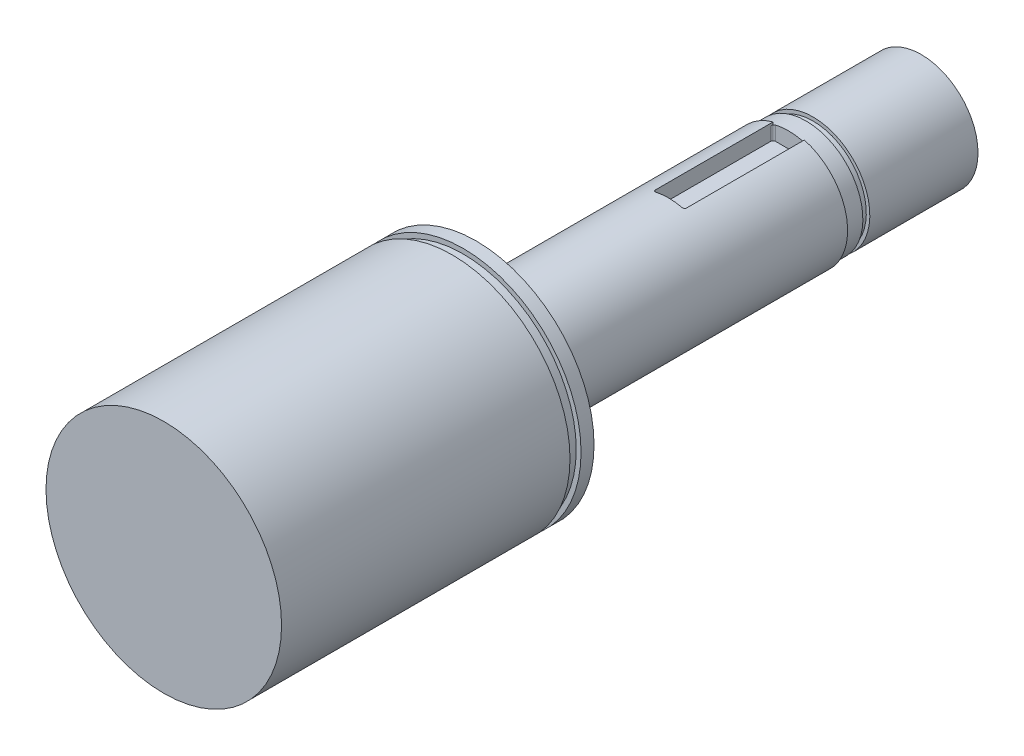
ISO-10303-21;
HEADER;
FILE_DESCRIPTION(('STEP AP214'),'2;1');
FILE_NAME('part.step','',(''),(''),'','','');
FILE_SCHEMA(('AUTOMOTIVE_DESIGN { 1 0 10303 214 1 1 1 1 }'));
ENDSEC;
DATA;
#1=APPLICATION_CONTEXT('core data for automotive mechanical design processes');
#2=APPLICATION_PROTOCOL_DEFINITION('international standard','automotive_design',2000,#1);
#3=PRODUCT_CONTEXT('',#1,'mechanical');
#4=PRODUCT('Part','Part','',(#3));
#5=PRODUCT_RELATED_PRODUCT_CATEGORY('part','',(#4));
#6=PRODUCT_DEFINITION_FORMATION('','',#4);
#7=PRODUCT_DEFINITION_CONTEXT('part definition',#1,'design');
#8=PRODUCT_DEFINITION('design','',#6,#7);
#9=PRODUCT_DEFINITION_SHAPE('','',#8);
#10=(LENGTH_UNIT() NAMED_UNIT(*) SI_UNIT(.MILLI.,.METRE.));
#11=(NAMED_UNIT(*) PLANE_ANGLE_UNIT() SI_UNIT($,.RADIAN.));
#12=(NAMED_UNIT(*) SI_UNIT($,.STERADIAN.) SOLID_ANGLE_UNIT());
#13=UNCERTAINTY_MEASURE_WITH_UNIT(LENGTH_MEASURE(1.E-05),#10,'distance_accuracy_value','');
#14=(GEOMETRIC_REPRESENTATION_CONTEXT(3) GLOBAL_UNCERTAINTY_ASSIGNED_CONTEXT((#13)) GLOBAL_UNIT_ASSIGNED_CONTEXT((#10,
#11,#12)) REPRESENTATION_CONTEXT('',''));
#15=CARTESIAN_POINT('',(0.,0.,0.));
#16=DIRECTION('',(0.,0.,1.));
#17=DIRECTION('',(1.,0.,0.));
#18=AXIS2_PLACEMENT_3D('',#15,#16,#17);
#19=CARTESIAN_POINT('',(0.,0.,33.02));
#20=DIRECTION('',(0.,0.,-1.));
#21=DIRECTION('',(-1.,0.,0.));
#22=AXIS2_PLACEMENT_3D('',#19,#20,#21);
#23=CYLINDRICAL_SURFACE('',#22,6.223);
#24=CARTESIAN_POINT('',(0.,0.,0.));
#25=DIRECTION('',(0.,0.,1.));
#26=DIRECTION('',(1.,0.,0.));
#27=AXIS2_PLACEMENT_3D('',#24,#25,#26);
#28=CIRCLE('',#27,6.223);
#29=CARTESIAN_POINT('',(-1.651,5.999993999997,0.));
#30=VERTEX_POINT('',#29);
#31=CARTESIAN_POINT('',(1.651,5.999993999997,0.));
#32=VERTEX_POINT('',#31);
#33=EDGE_CURVE('E144',#30,#32,#28,.T.);
#34=ORIENTED_EDGE('',*,*,#33,.T.);
#35=DIRECTION('',(0.,0.,-1.));
#36=VECTOR('',#35,1.);
#37=CARTESIAN_POINT('',(1.651,5.999993999997,33.02));
#38=LINE('',#37,#36);
#39=CARTESIAN_POINT('',(1.651,5.999993999997,12.446));
#40=VERTEX_POINT('',#39);
#41=EDGE_CURVE('E169',#32,#40,#38,.F.);
#42=ORIENTED_EDGE('',*,*,#41,.T.);
#43=CARTESIAN_POINT('',(1.651,5.999993999997,12.446));
#44=CARTESIAN_POINT('',(1.6510136591132,5.99998885600186,12.4599371532582));
#45=CARTESIAN_POINT('',(1.6498537940889,6.00030938344019,12.473867225153));
#46=CARTESIAN_POINT('',(1.64529192026899,6.00156258454862,12.5013011630621));
#47=CARTESIAN_POINT('',(1.64189411683366,6.00249411006494,12.514805778784));
#48=CARTESIAN_POINT('',(1.63296019772344,6.00493047717273,12.5410329475935));
#49=CARTESIAN_POINT('',(1.62742390823833,6.00643536536539,12.5537554370146));
#50=CARTESIAN_POINT('',(1.61439639075044,6.00994999603842,12.5780798810677));
#51=CARTESIAN_POINT('',(1.60690488308525,6.01195981073884,12.5896816750768));
#52=CARTESIAN_POINT('',(1.59005297817903,6.01643893737926,12.6116547380317));
#53=CARTESIAN_POINT('',(1.58066333766302,6.01891539200831,12.6220020993992));
#54=CARTESIAN_POINT('',(1.56037002430933,6.02420818200575,12.6409855630794));
#55=CARTESIAN_POINT('',(1.54946594231671,6.02702460919715,12.6496212014024));
#56=CARTESIAN_POINT('',(1.52606255784957,6.03299365715654,12.6652332823865));
#57=CARTESIAN_POINT('',(1.51352242704203,6.03615431562268,12.6721454129126));
#58=CARTESIAN_POINT('',(1.48749417753384,6.04262109166117,12.6837598850571));
#59=CARTESIAN_POINT('',(1.47400630082956,6.0459271720216,12.6884627884369));
#60=CARTESIAN_POINT('',(1.44990836609662,6.05174416176689,12.6946571828533));
#61=CARTESIAN_POINT('',(1.43942410890025,6.05424673157387,12.6966580963021));
#62=CARTESIAN_POINT('',(1.41829673705527,6.05923119850961,12.6993296549334));
#63=CARTESIAN_POINT('',(1.40765383682191,6.061713117527,12.7000019559701));
#64=CARTESIAN_POINT('',(1.397,6.06416688424717,12.7));
#65=B_SPLINE_CURVE_WITH_KNOTS('',3,(#43,#44,#45,#46,#47,#48,#49,#50,#51,#52,#53,#54,#55,#56,#57,
#58,#59,#60,#61,#62,#63,#64),.UNSPECIFIED.,.F.,.F.,(4,2,2,2,2,2,2,2,2,2,4),(0.,
0.0417488156054149,0.0834194030451652,0.125093378067803,0.166773317150151,0.209152456981567,
0.251543068690232,0.295335507240234,0.339116804228455,0.371927199746421,0.40469667770493),.UNSPECIFIED.);
#66=CARTESIAN_POINT('',(1.397,6.06416688424717,12.7));
#67=VERTEX_POINT('',#66);
#68=EDGE_CURVE('E49',#40,#67,#65,.T.);
#69=ORIENTED_EDGE('',*,*,#68,.T.);
#70=CARTESIAN_POINT('',(0.,0.,12.7));
#71=DIRECTION('',(0.,0.,-1.));
#72=DIRECTION('',(-1.,0.,0.));
#73=AXIS2_PLACEMENT_3D('',#70,#71,#72);
#74=CIRCLE('',#73,6.223);
#75=CARTESIAN_POINT('',(-1.397,6.06416688424717,12.7));
#76=VERTEX_POINT('',#75);
#77=EDGE_CURVE('E139',#76,#67,#74,.T.);
#78=ORIENTED_EDGE('',*,*,#77,.F.);
#79=CARTESIAN_POINT('',(-1.397,6.06416688424717,12.7));
#80=CARTESIAN_POINT('',(-1.41165090529352,6.06079390642007,12.700010270971));
#81=CARTESIAN_POINT('',(-1.42628522450905,6.05736460837732,12.6987330395745));
#82=CARTESIAN_POINT('',(-1.45511557715207,6.05050247974281,12.69369188033));
#83=CARTESIAN_POINT('',(-1.46931169749557,6.04706964999295,12.6899284489764));
#84=CARTESIAN_POINT('',(-1.49687397781058,6.04030634903221,12.6800005140272));
#85=CARTESIAN_POINT('',(-1.51023969599947,6.03697593277421,12.6738347448327));
#86=CARTESIAN_POINT('',(-1.53574481264174,6.03053807691927,12.659263665385));
#87=CARTESIAN_POINT('',(-1.54788455576024,6.02743057472483,12.6508589869994));
#88=CARTESIAN_POINT('',(-1.57048207326345,6.02158206406083,12.6321017576408));
#89=CARTESIAN_POINT('',(-1.58095273326457,6.01883827849694,12.6217656175073));
#90=CARTESIAN_POINT('',(-1.59999919464336,6.0138031951122,12.5993729634366));
#91=CARTESIAN_POINT('',(-1.60857481888172,6.01151193959392,12.587316288845));
#92=CARTESIAN_POINT('',(-1.62332418480106,6.0075456300982,12.5621883274646));
#93=CARTESIAN_POINT('',(-1.62955873906087,6.00585504693317,12.549155151668));
#94=CARTESIAN_POINT('',(-1.63973781672755,6.00308395845329,12.5221690940492));
#95=CARTESIAN_POINT('',(-1.64368485486539,6.00200278323511,12.5082172410241));
#96=CARTESIAN_POINT('',(-1.64794141373288,6.00083497827377,12.4861186857271));
#97=CARTESIAN_POINT('',(-1.64908770036318,6.00051995801422,12.4781359369184));
#98=CARTESIAN_POINT('',(-1.65061671687385,6.0000994744892,12.4621034918921));
#99=CARTESIAN_POINT('',(-1.65100051257263,5.99999371871231,12.4540539049398));
#100=CARTESIAN_POINT('',(-1.65100000000012,5.99999399999709,12.446));
#101=B_SPLINE_CURVE_WITH_KNOTS('',3,(#79,#80,#81,#82,#83,#84,#85,#86,#87,#88,#89,#90,#91,#92,
#93,#94,#95,#96,#97,#98,#99,#100),.UNSPECIFIED.,.F.,.F.,(4,2,2,2,2,2,2,2,2,2,4),(0.,
0.0450436059598747,0.0900782194225985,0.135136590154683,0.180182257906668,0.224861291388814,
0.269544499498677,0.312969989332677,0.356347649301799,0.380524910361107,0.404668352327528),.UNSPECIFIED.);
#102=CARTESIAN_POINT('',(-1.651,5.999993999997,12.446));
#103=VERTEX_POINT('',#102);
#104=EDGE_CURVE('E11',#76,#103,#101,.T.);
#105=ORIENTED_EDGE('',*,*,#104,.T.);
#106=DIRECTION('',(0.,0.,-1.));
#107=VECTOR('',#106,1.);
#108=CARTESIAN_POINT('',(-1.651,5.999993999997,33.02));
#109=LINE('',#108,#107);
#110=EDGE_CURVE('E167',#103,#30,#109,.T.);
#111=ORIENTED_EDGE('',*,*,#110,.T.);
#112=EDGE_LOOP('',(#34,#42,#69,#78,#105,#111));
#113=FACE_BOUND('',#112,.T.);
#114=CARTESIAN_POINT('',(0.,0.,33.02));
#115=DIRECTION('',(0.,0.,1.));
#116=DIRECTION('',(1.,0.,0.));
#117=AXIS2_PLACEMENT_3D('',#114,#115,#116);
#118=CIRCLE('',#117,6.223);
#119=CARTESIAN_POINT('',(6.223,0.,33.02));
#120=VERTEX_POINT('',#119);
#121=EDGE_CURVE('E178',#120,#120,#118,.T.);
#122=ORIENTED_EDGE('',*,*,#121,.F.);
#123=EDGE_LOOP('',(#122));
#124=FACE_BOUND('',#123,.T.);
#125=ADVANCED_FACE('F35',(#113,#124),#23,.T.);
#126=CARTESIAN_POINT('',(0.,0.,0.));
#127=DIRECTION('',(0.,0.,1.));
#128=DIRECTION('',(1.,0.,0.));
#129=AXIS2_PLACEMENT_3D('',#126,#127,#128);
#130=PLANE('',#129);
#131=DIRECTION('',(0.,1.,0.));
#132=VECTOR('',#131,1.);
#133=CARTESIAN_POINT('',(-1.651,7.650993999997,0.));
#134=LINE('',#133,#132);
#135=CARTESIAN_POINT('',(-1.651,5.76837923510582,0.));
#136=VERTEX_POINT('',#135);
#137=EDGE_CURVE('E125',#136,#30,#134,.T.);
#138=ORIENTED_EDGE('',*,*,#137,.F.);
#139=CARTESIAN_POINT('',(0.,0.,0.));
#140=DIRECTION('',(0.,0.,1.));
#141=DIRECTION('',(0.124481116014532,-0.992221977057441,0.));
#142=AXIS2_PLACEMENT_3D('',#139,#140,#141);
#143=CIRCLE('',#142,6.);
#144=CARTESIAN_POINT('',(1.651,5.76837923510582,0.));
#145=VERTEX_POINT('',#144);
#146=EDGE_CURVE('E132',#136,#145,#143,.T.);
#147=ORIENTED_EDGE('',*,*,#146,.T.);
#148=DIRECTION('',(0.,-1.,0.));
#149=VECTOR('',#148,1.);
#150=CARTESIAN_POINT('',(1.651,7.650993999997,0.));
#151=LINE('',#150,#149);
#152=EDGE_CURVE('E152',#32,#145,#151,.T.);
#153=ORIENTED_EDGE('',*,*,#152,.F.);
#154=ORIENTED_EDGE('',*,*,#33,.F.);
#155=EDGE_LOOP('',(#138,#147,#153,#154));
#156=FACE_BOUND('',#155,.T.);
#157=ADVANCED_FACE('F142',(#156),#130,.F.);
#158=CARTESIAN_POINT('',(0.,0.,66.04));
#159=DIRECTION('',(0.,0.,-1.));
#160=DIRECTION('',(-1.,0.,0.));
#161=AXIS2_PLACEMENT_3D('',#158,#159,#160);
#162=CYLINDRICAL_SURFACE('',#161,12.446);
#163=CARTESIAN_POINT('',(0.,0.,34.3916));
#164=DIRECTION('',(0.,0.,-1.));
#165=DIRECTION('',(-1.,0.,0.));
#166=AXIS2_PLACEMENT_3D('',#163,#164,#165);
#167=CIRCLE('',#166,12.446);
#168=CARTESIAN_POINT('',(-12.446,0.,34.3916));
#169=VERTEX_POINT('',#168);
#170=EDGE_CURVE('E170',#169,#169,#167,.T.);
#171=ORIENTED_EDGE('',*,*,#170,.T.);
#172=EDGE_LOOP('',(#171));
#173=FACE_BOUND('',#172,.T.);
#174=CARTESIAN_POINT('',(0.,0.,33.02));
#175=DIRECTION('',(0.,0.,1.));
#176=DIRECTION('',(1.,0.,0.));
#177=AXIS2_PLACEMENT_3D('',#174,#175,#176);
#178=CIRCLE('',#177,12.446);
#179=CARTESIAN_POINT('',(12.446,0.,33.02));
#180=VERTEX_POINT('',#179);
#181=EDGE_CURVE('E172',#180,#180,#178,.T.);
#182=ORIENTED_EDGE('',*,*,#181,.T.);
#183=EDGE_LOOP('',(#182));
#184=FACE_BOUND('',#183,.T.);
#185=ADVANCED_FACE('F310',(#173,#184),#162,.T.);
#186=CARTESIAN_POINT('',(0.,0.,33.02));
#187=DIRECTION('',(0.,0.,1.));
#188=DIRECTION('',(1.,0.,0.));
#189=AXIS2_PLACEMENT_3D('',#186,#187,#188);
#190=PLANE('',#189);
#191=ORIENTED_EDGE('',*,*,#121,.T.);
#192=EDGE_LOOP('',(#191));
#193=FACE_BOUND('',#192,.T.);
#194=ORIENTED_EDGE('',*,*,#181,.F.);
#195=EDGE_LOOP('',(#194));
#196=FACE_BOUND('',#195,.T.);
#197=ADVANCED_FACE('F314',(#193,#196),#190,.F.);
#198=CARTESIAN_POINT('',(0.,0.,34.3916));
#199=DIRECTION('',(0.,0.,-1.));
#200=DIRECTION('',(-1.,0.,0.));
#201=AXIS2_PLACEMENT_3D('',#198,#199,#200);
#202=PLANE('',#201);
#203=CARTESIAN_POINT('',(0.,0.,34.3916));
#204=DIRECTION('',(0.,0.,1.));
#205=DIRECTION('',(1.,0.,0.));
#206=AXIS2_PLACEMENT_3D('',#203,#204,#205);
#207=CIRCLE('',#206,11.938);
#208=CARTESIAN_POINT('',(11.938,0.,34.3916));
#209=VERTEX_POINT('',#208);
#210=EDGE_CURVE('E161',#209,#209,#207,.T.);
#211=ORIENTED_EDGE('',*,*,#210,.F.);
#212=EDGE_LOOP('',(#211));
#213=FACE_BOUND('',#212,.T.);
#214=ORIENTED_EDGE('',*,*,#170,.F.);
#215=EDGE_LOOP('',(#214));
#216=FACE_BOUND('',#215,.T.);
#217=ADVANCED_FACE('F317',(#213,#216),#202,.F.);
#218=CARTESIAN_POINT('',(0.,0.,35.56));
#219=DIRECTION('',(0.,0.,-1.));
#220=DIRECTION('',(-1.,0.,0.));
#221=AXIS2_PLACEMENT_3D('',#218,#219,#220);
#222=PLANE('',#221);
#223=CARTESIAN_POINT('',(0.,0.,35.56));
#224=DIRECTION('',(0.,0.,1.));
#225=DIRECTION('',(1.,0.,0.));
#226=AXIS2_PLACEMENT_3D('',#223,#224,#225);
#227=CIRCLE('',#226,11.938);
#228=CARTESIAN_POINT('',(11.938,0.,35.56));
#229=VERTEX_POINT('',#228);
#230=EDGE_CURVE('E158',#229,#229,#227,.T.);
#231=ORIENTED_EDGE('',*,*,#230,.T.);
#232=EDGE_LOOP('',(#231));
#233=FACE_BOUND('',#232,.T.);
#234=CARTESIAN_POINT('',(0.,0.,35.56));
#235=DIRECTION('',(0.,0.,-1.));
#236=DIRECTION('',(-1.,0.,0.));
#237=AXIS2_PLACEMENT_3D('',#234,#235,#236);
#238=CIRCLE('',#237,12.446);
#239=CARTESIAN_POINT('',(-12.446,0.,35.56));
#240=VERTEX_POINT('',#239);
#241=EDGE_CURVE('E164',#240,#240,#238,.T.);
#242=ORIENTED_EDGE('',*,*,#241,.T.);
#243=EDGE_LOOP('',(#242));
#244=FACE_BOUND('',#243,.T.);
#245=ADVANCED_FACE('F341',(#233,#244),#222,.T.);
#246=CARTESIAN_POINT('',(0.,0.,34.3916));
#247=DIRECTION('',(0.,0.,1.));
#248=DIRECTION('',(1.,0.,0.));
#249=AXIS2_PLACEMENT_3D('',#246,#247,#248);
#250=CYLINDRICAL_SURFACE('',#249,11.938);
#251=ORIENTED_EDGE('',*,*,#210,.T.);
#252=EDGE_LOOP('',(#251));
#253=FACE_BOUND('',#252,.T.);
#254=ORIENTED_EDGE('',*,*,#230,.F.);
#255=EDGE_LOOP('',(#254));
#256=FACE_BOUND('',#255,.T.);
#257=ADVANCED_FACE('F334',(#253,#256),#250,.T.);
#258=CARTESIAN_POINT('',(0.,0.,66.04));
#259=DIRECTION('',(0.,0.,1.));
#260=DIRECTION('',(1.,0.,0.));
#261=AXIS2_PLACEMENT_3D('',#258,#259,#260);
#262=PLANE('',#261);
#263=CARTESIAN_POINT('',(0.,0.,66.04));
#264=DIRECTION('',(0.,0.,1.));
#265=DIRECTION('',(1.,0.,0.));
#266=AXIS2_PLACEMENT_3D('',#263,#264,#265);
#267=CIRCLE('',#266,12.446);
#268=CARTESIAN_POINT('',(12.446,0.,66.04));
#269=VERTEX_POINT('',#268);
#270=EDGE_CURVE('E173',#269,#269,#267,.T.);
#271=ORIENTED_EDGE('',*,*,#270,.T.);
#272=EDGE_LOOP('',(#271));
#273=FACE_BOUND('',#272,.T.);
#274=ADVANCED_FACE('F328',(#273),#262,.T.);
#275=ORIENTED_EDGE('',*,*,#270,.F.);
#276=EDGE_LOOP('',(#275));
#277=FACE_BOUND('',#276,.T.);
#278=ORIENTED_EDGE('',*,*,#241,.F.);
#279=EDGE_LOOP('',(#278));
#280=FACE_BOUND('',#279,.T.);
#281=ADVANCED_FACE('F324',(#277,#280),#162,.T.);
#282=CARTESIAN_POINT('',(0.,0.,12.7));
#283=DIRECTION('',(0.,0.,-1.));
#284=DIRECTION('',(-1.,0.,0.));
#285=AXIS2_PLACEMENT_3D('',#282,#283,#284);
#286=PLANE('',#285);
#287=ORIENTED_EDGE('',*,*,#77,.T.);
#288=DIRECTION('',(0.,-1.,0.));
#289=VECTOR('',#288,1.);
#290=CARTESIAN_POINT('',(1.397,0.,12.7));
#291=LINE('',#290,#289);
#292=CARTESIAN_POINT('',(1.397,4.348993999997,12.7));
#293=VERTEX_POINT('',#292);
#294=EDGE_CURVE('E209',#67,#293,#291,.T.);
#295=ORIENTED_EDGE('',*,*,#294,.T.);
#296=DIRECTION('',(-1.,0.,0.));
#297=VECTOR('',#296,1.);
#298=CARTESIAN_POINT('',(1.651,4.348993999997,12.7));
#299=LINE('',#298,#297);
#300=CARTESIAN_POINT('',(-1.397,4.348993999997,12.7));
#301=VERTEX_POINT('',#300);
#302=EDGE_CURVE('E145',#293,#301,#299,.T.);
#303=ORIENTED_EDGE('',*,*,#302,.T.);
#304=DIRECTION('',(0.,1.,0.));
#305=VECTOR('',#304,1.);
#306=CARTESIAN_POINT('',(-1.397,0.,12.7));
#307=LINE('',#306,#305);
#308=EDGE_CURVE('E206',#301,#76,#307,.T.);
#309=ORIENTED_EDGE('',*,*,#308,.T.);
#310=EDGE_LOOP('',(#287,#295,#303,#309));
#311=FACE_BOUND('',#310,.T.);
#312=ADVANCED_FACE('F266',(#311),#286,.T.);
#313=CARTESIAN_POINT('',(1.651,7.650993999997,12.7));
#314=DIRECTION('',(1.,0.,0.));
#315=DIRECTION('',(0.,0.,-1.));
#316=AXIS2_PLACEMENT_3D('',#313,#314,#315);
#317=PLANE('',#316);
#318=DIRECTION('',(0.,0.,-1.));
#319=VECTOR('',#318,1.);
#320=CARTESIAN_POINT('',(1.651,5.76837923510582,0.));
#321=LINE('',#320,#319);
#322=CARTESIAN_POINT('',(1.651,5.76837923510582,0.254000000000003));
#323=VERTEX_POINT('',#322);
#324=EDGE_CURVE('E56',#145,#323,#321,.F.);
#325=ORIENTED_EDGE('',*,*,#324,.T.);
#326=DIRECTION('',(0.,-1.,0.));
#327=VECTOR('',#326,1.);
#328=CARTESIAN_POINT('',(1.651,7.650993999997,0.254000000000003));
#329=LINE('',#328,#327);
#330=CARTESIAN_POINT('',(1.651,4.348993999997,0.254000000000003));
#331=VERTEX_POINT('',#330);
#332=EDGE_CURVE('E189',#323,#331,#329,.T.);
#333=ORIENTED_EDGE('',*,*,#332,.T.);
#334=DIRECTION('',(0.,0.,-1.));
#335=VECTOR('',#334,1.);
#336=CARTESIAN_POINT('',(1.651,4.348993999997,12.7));
#337=LINE('',#336,#335);
#338=CARTESIAN_POINT('',(1.651,4.348993999997,12.446));
#339=VERTEX_POINT('',#338);
#340=EDGE_CURVE('E149',#339,#331,#337,.T.);
#341=ORIENTED_EDGE('',*,*,#340,.F.);
#342=DIRECTION('',(0.,-1.,0.));
#343=VECTOR('',#342,1.);
#344=CARTESIAN_POINT('',(1.651,7.650993999997,12.446));
#345=LINE('',#344,#343);
#346=EDGE_CURVE('E138',#339,#40,#345,.F.);
#347=ORIENTED_EDGE('',*,*,#346,.T.);
#348=ORIENTED_EDGE('',*,*,#41,.F.);
#349=ORIENTED_EDGE('',*,*,#152,.T.);
#350=EDGE_LOOP('',(#325,#333,#341,#347,#348,#349));
#351=FACE_BOUND('',#350,.T.);
#352=ADVANCED_FACE('F271',(#351),#317,.F.);
#353=CARTESIAN_POINT('',(-1.651,7.650993999997,12.7));
#354=DIRECTION('',(-1.,0.,0.));
#355=DIRECTION('',(0.,-1.,0.));
#356=AXIS2_PLACEMENT_3D('',#353,#354,#355);
#357=PLANE('',#356);
#358=DIRECTION('',(0.,0.,-1.));
#359=VECTOR('',#358,1.);
#360=CARTESIAN_POINT('',(-1.651,4.348993999997,12.7));
#361=LINE('',#360,#359);
#362=CARTESIAN_POINT('',(-1.651,4.348993999997,12.446));
#363=VERTEX_POINT('',#362);
#364=CARTESIAN_POINT('',(-1.651,4.348993999997,0.254000000000003));
#365=VERTEX_POINT('',#364);
#366=EDGE_CURVE('E156',#363,#365,#361,.T.);
#367=ORIENTED_EDGE('',*,*,#366,.T.);
#368=DIRECTION('',(0.,1.,0.));
#369=VECTOR('',#368,1.);
#370=CARTESIAN_POINT('',(-1.651,7.650993999997,0.254000000000003));
#371=LINE('',#370,#369);
#372=CARTESIAN_POINT('',(-1.651,5.76837923510582,0.254000000000003));
#373=VERTEX_POINT('',#372);
#374=EDGE_CURVE('E128',#365,#373,#371,.T.);
#375=ORIENTED_EDGE('',*,*,#374,.T.);
#376=DIRECTION('',(0.,0.,-1.));
#377=VECTOR('',#376,1.);
#378=CARTESIAN_POINT('',(-1.651,5.76837923510582,0.254000000000003));
#379=LINE('',#378,#377);
#380=EDGE_CURVE('E120',#373,#136,#379,.T.);
#381=ORIENTED_EDGE('',*,*,#380,.T.);
#382=ORIENTED_EDGE('',*,*,#137,.T.);
#383=ORIENTED_EDGE('',*,*,#110,.F.);
#384=DIRECTION('',(0.,1.,0.));
#385=VECTOR('',#384,1.);
#386=CARTESIAN_POINT('',(-1.651,7.650993999997,12.446));
#387=LINE('',#386,#385);
#388=EDGE_CURVE('E129',#103,#363,#387,.F.);
#389=ORIENTED_EDGE('',*,*,#388,.T.);
#390=EDGE_LOOP('',(#367,#375,#381,#382,#383,#389));
#391=FACE_BOUND('',#390,.T.);
#392=ADVANCED_FACE('F122',(#391),#357,.F.);
#393=CARTESIAN_POINT('',(1.651,4.348993999997,12.7));
#394=DIRECTION('',(0.,-1.,0.));
#395=DIRECTION('',(1.,0.,0.));
#396=AXIS2_PLACEMENT_3D('',#393,#394,#395);
#397=PLANE('',#396);
#398=ORIENTED_EDGE('',*,*,#340,.T.);
#399=CARTESIAN_POINT('',(1.397,4.348993999997,0.254000000000003));
#400=DIRECTION('',(0.,-1.,0.));
#401=DIRECTION('',(1.,0.,0.));
#402=AXIS2_PLACEMENT_3D('',#399,#400,#401);
#403=CIRCLE('',#402,0.254);
#404=CARTESIAN_POINT('',(1.397,4.348993999997,0.));
#405=VERTEX_POINT('',#404);
#406=EDGE_CURVE('E198',#331,#405,#403,.F.);
#407=ORIENTED_EDGE('',*,*,#406,.T.);
#408=DIRECTION('',(-1.,0.,0.));
#409=VECTOR('',#408,1.);
#410=CARTESIAN_POINT('',(1.651,4.348993999997,0.));
#411=LINE('',#410,#409);
#412=CARTESIAN_POINT('',(-1.397,4.348993999997,0.));
#413=VERTEX_POINT('',#412);
#414=EDGE_CURVE('E146',#405,#413,#411,.T.);
#415=ORIENTED_EDGE('',*,*,#414,.T.);
#416=CARTESIAN_POINT('',(-1.397,4.348993999997,0.254000000000003));
#417=DIRECTION('',(0.,-1.,0.));
#418=DIRECTION('',(1.,0.,0.));
#419=AXIS2_PLACEMENT_3D('',#416,#417,#418);
#420=CIRCLE('',#419,0.254);
#421=EDGE_CURVE('E196',#413,#365,#420,.F.);
#422=ORIENTED_EDGE('',*,*,#421,.T.);
#423=ORIENTED_EDGE('',*,*,#366,.F.);
#424=CARTESIAN_POINT('',(-1.397,4.348993999997,12.446));
#425=DIRECTION('',(0.,-1.,0.));
#426=DIRECTION('',(1.,0.,0.));
#427=AXIS2_PLACEMENT_3D('',#424,#425,#426);
#428=CIRCLE('',#427,0.254);
#429=EDGE_CURVE('E192',#363,#301,#428,.F.);
#430=ORIENTED_EDGE('',*,*,#429,.T.);
#431=ORIENTED_EDGE('',*,*,#302,.F.);
#432=CARTESIAN_POINT('',(1.397,4.348993999997,12.446));
#433=DIRECTION('',(0.,-1.,0.));
#434=DIRECTION('',(1.,0.,0.));
#435=AXIS2_PLACEMENT_3D('',#432,#433,#434);
#436=CIRCLE('',#435,0.254);
#437=EDGE_CURVE('E194',#293,#339,#436,.F.);
#438=ORIENTED_EDGE('',*,*,#437,.T.);
#439=EDGE_LOOP('',(#398,#407,#415,#422,#423,#430,#431,#438));
#440=FACE_BOUND('',#439,.T.);
#441=ADVANCED_FACE('F259',(#440),#397,.F.);
#442=CARTESIAN_POINT('',(0.,0.,0.));
#443=DIRECTION('',(0.,0.,1.));
#444=DIRECTION('',(0.124481116014532,-0.992221977057441,0.));
#445=AXIS2_PLACEMENT_3D('',#442,#443,#444);
#446=PLANE('',#445);
#447=ORIENTED_EDGE('',*,*,#414,.F.);
#448=DIRECTION('',(0.,-1.,0.));
#449=VECTOR('',#448,1.);
#450=CARTESIAN_POINT('',(1.397,0.,0.));
#451=LINE('',#450,#449);
#452=CARTESIAN_POINT('',(1.397,5.83509991345478,0.));
#453=VERTEX_POINT('',#452);
#454=EDGE_CURVE('E202',#405,#453,#451,.F.);
#455=ORIENTED_EDGE('',*,*,#454,.T.);
#456=CARTESIAN_POINT('',(-1.397,5.83509991345478,0.));
#457=VERTEX_POINT('',#456);
#458=EDGE_CURVE('E141',#453,#457,#143,.T.);
#459=ORIENTED_EDGE('',*,*,#458,.T.);
#460=DIRECTION('',(0.,1.,0.));
#461=VECTOR('',#460,1.);
#462=CARTESIAN_POINT('',(-1.397,0.,0.));
#463=LINE('',#462,#461);
#464=EDGE_CURVE('E200',#457,#413,#463,.F.);
#465=ORIENTED_EDGE('',*,*,#464,.T.);
#466=EDGE_LOOP('',(#447,#455,#459,#465));
#467=FACE_BOUND('',#466,.T.);
#468=ADVANCED_FACE('F253',(#467),#446,.T.);
#469=CARTESIAN_POINT('',(0.,0.,0.));
#470=DIRECTION('',(0.,0.,-1.));
#471=DIRECTION('',(-0.124481116014532,0.992221977057441,0.));
#472=AXIS2_PLACEMENT_3D('',#469,#470,#471);
#473=CYLINDRICAL_SURFACE('',#472,6.);
#474=ORIENTED_EDGE('',*,*,#458,.F.);
#475=CARTESIAN_POINT('',(1.397,5.83509991345478,0.));
#476=CARTESIAN_POINT('',(1.41168005202716,5.83158756265605,-1.01121972809045E-05));
#477=CARTESIAN_POINT('',(1.426342418772,5.82801644337592,0.00127201509164531));
#478=CARTESIAN_POINT('',(1.45522688614268,5.82087012761101,0.00633252400766711));
#479=CARTESIAN_POINT('',(1.46944905379564,5.81729493183376,0.0101105236226409));
#480=CARTESIAN_POINT('',(1.4970602909675,5.81025091024581,0.0200772471224719));
#481=CARTESIAN_POINT('',(1.51044891437681,5.80678214188984,0.0262672492545811));
#482=CARTESIAN_POINT('',(1.53599541367031,5.80007690598006,0.0408973377707836));
#483=CARTESIAN_POINT('',(1.54815364487477,5.79684037143935,0.049336771976914));
#484=CARTESIAN_POINT('',(1.57077360300868,5.79075182133764,0.06816828569239));
#485=CARTESIAN_POINT('',(1.58124933665287,5.78789666844664,0.0785425014253528));
#486=CARTESIAN_POINT('',(1.60029825452638,5.78265884652916,0.101020496168649));
#487=CARTESIAN_POINT('',(1.60887128017487,5.78027621688679,0.113124419202994));
#488=CARTESIAN_POINT('',(1.62358678273083,5.77615986488363,0.138323985359171));
#489=CARTESIAN_POINT('',(1.62979526885433,5.77440860622011,0.151378254964639));
#490=CARTESIAN_POINT('',(1.63991820422869,5.77154193104013,0.178406446428422));
#491=CARTESIAN_POINT('',(1.64383526932969,5.77042578952381,0.192379299287722));
#492=CARTESIAN_POINT('',(1.64802011452032,5.76923148442176,0.214397859338737));
#493=CARTESIAN_POINT('',(1.64913691359821,5.76891223690401,0.22227875703264));
#494=CARTESIAN_POINT('',(1.65062656926735,5.7684861250279,0.238105074270113));
#495=CARTESIAN_POINT('',(1.65100046429985,5.76837896421274,0.246050388140467));
#496=CARTESIAN_POINT('',(1.65100000000009,5.7683792351059,0.253999999999989));
#497=B_SPLINE_CURVE_WITH_KNOTS('',3,(#475,#476,#477,#478,#479,#480,#481,#482,#483,#484,#485,
#486,#487,#488,#489,#490,#491,#492,#493,#494,#495,#496),.UNSPECIFIED.,.F.,.F.,(4,2,2,2,2,2,2,2,
2,2,4),(0.,0.0452241178523169,0.0904413154148084,0.135682508615405,0.180910599275499,
0.225740102710843,0.270573341050337,0.3140426301776,0.357462198117964,0.381326500652907,
0.405157421812179),.UNSPECIFIED.);
#498=EDGE_CURVE('E212',#453,#323,#497,.T.);
#499=ORIENTED_EDGE('',*,*,#498,.T.);
#500=ORIENTED_EDGE('',*,*,#324,.F.);
#501=ORIENTED_EDGE('',*,*,#146,.F.);
#502=ORIENTED_EDGE('',*,*,#380,.F.);
#503=CARTESIAN_POINT('',(-1.651,5.76837923510582,0.254000000000003));
#504=CARTESIAN_POINT('',(-1.65101376688851,5.76837385899415,0.240089923334392));
#505=CARTESIAN_POINT('',(-1.64985825930497,5.7687060046658,0.226187192860126));
#506=CARTESIAN_POINT('',(-1.64531470153301,5.77000428602704,0.198808761602488));
#507=CARTESIAN_POINT('',(-1.64193102166331,5.77096918063274,0.185332278899168));
#508=CARTESIAN_POINT('',(-1.63303615394639,5.77349226191792,0.1591606079784));
#509=CARTESIAN_POINT('',(-1.62752485907568,5.77505047844268,0.146465459100934));
#510=CARTESIAN_POINT('',(-1.61455891612552,5.7786888642692,0.122191836004363));
#511=CARTESIAN_POINT('',(-1.60710394346588,5.7807691207457,0.110613548735942));
#512=CARTESIAN_POINT('',(-1.59032697919811,5.78540723566566,0.0886672373298728));
#513=CARTESIAN_POINT('',(-1.58097374714299,5.78797302941505,0.0783247997100719));
#514=CARTESIAN_POINT('',(-1.56076048868596,5.79345632932232,0.0593444005055745));
#515=CARTESIAN_POINT('',(-1.54990004853658,5.79637393202722,0.0507069085322884));
#516=CARTESIAN_POINT('',(-1.52656119988887,5.80256508625676,0.0350610624226804));
#517=CARTESIAN_POINT('',(-1.51403892737039,5.8058476168945,0.0281217279892138));
#518=CARTESIAN_POINT('',(-1.48804428329497,5.81256433985563,0.0164504162625649));
#519=CARTESIAN_POINT('',(-1.4745721299958,5.8159984972718,0.0117179337829477));
#520=CARTESIAN_POINT('',(-1.45039748953997,5.82206683713253,0.00544311546289184));
#521=CARTESIAN_POINT('',(-1.43981861172329,5.824692372028,0.00340475889384983));
#522=CARTESIAN_POINT('',(-1.41849687873235,5.82992184522095,0.000683029232188858));
#523=CARTESIAN_POINT('',(-1.40775424203564,5.83252580617221,-2.01295133746202E-06));
#524=CARTESIAN_POINT('',(-1.397,5.83509991345478,0.));
#525=B_SPLINE_CURVE_WITH_KNOTS('',3,(#503,#504,#505,#506,#507,#508,#509,#510,#511,#512,#513,
#514,#515,#516,#517,#518,#519,#520,#521,#522,#523,#524),.UNSPECIFIED.,.F.,.F.,(4,2,2,2,2,2,2,2,
2,2,4),(0.,0.0416671468028204,0.0832528104638378,0.124840566243687,0.166435271332729,
0.208779969674462,0.251136315243538,0.295001973126161,0.338857584468503,0.372043282190441,
0.405188025191536),.UNSPECIFIED.);
#526=EDGE_CURVE('E220',#373,#457,#525,.T.);
#527=ORIENTED_EDGE('',*,*,#526,.T.);
#528=EDGE_LOOP('',(#474,#499,#500,#501,#502,#527));
#529=FACE_BOUND('',#528,.T.);
#530=CARTESIAN_POINT('',(0.,0.,-1.8334));
#531=DIRECTION('',(0.,0.,-1.));
#532=DIRECTION('',(-0.124481116014532,0.992221977057441,0.));
#533=AXIS2_PLACEMENT_3D('',#530,#531,#532);
#534=CIRCLE('',#533,6.);
#535=CARTESIAN_POINT('',(-0.746886696087194,5.95333186234465,-1.8334));
#536=VERTEX_POINT('',#535);
#537=EDGE_CURVE('E274',#536,#536,#534,.T.);
#538=ORIENTED_EDGE('',*,*,#537,.F.);
#539=EDGE_LOOP('',(#538));
#540=FACE_BOUND('',#539,.T.);
#541=ADVANCED_FACE('F134',(#529,#540),#473,.T.);
#542=CARTESIAN_POINT('',(0.,0.,-1.8334));
#543=DIRECTION('',(0.,0.,-1.));
#544=DIRECTION('',(-0.124481116014532,0.992221977057441,0.));
#545=AXIS2_PLACEMENT_3D('',#542,#543,#544);
#546=PLANE('',#545);
#547=CARTESIAN_POINT('',(0.,0.,-1.8334));
#548=DIRECTION('',(0.,0.,-1.));
#549=DIRECTION('',(-0.124481116014532,0.992221977057441,0.));
#550=AXIS2_PLACEMENT_3D('',#547,#548,#549);
#551=CIRCLE('',#550,5.6261);
#552=CARTESIAN_POINT('',(-0.700343206809361,5.58234006512287,-1.8334));
#553=VERTEX_POINT('',#552);
#554=EDGE_CURVE('E280',#553,#553,#551,.T.);
#555=ORIENTED_EDGE('',*,*,#554,.F.);
#556=EDGE_LOOP('',(#555));
#557=FACE_BOUND('',#556,.T.);
#558=ORIENTED_EDGE('',*,*,#537,.T.);
#559=EDGE_LOOP('',(#558));
#560=FACE_BOUND('',#559,.T.);
#561=ADVANCED_FACE('F292',(#557,#560),#546,.T.);
#562=CARTESIAN_POINT('',(0.,0.,-2.57));
#563=DIRECTION('',(0.,0.,-1.));
#564=DIRECTION('',(-0.124481116014532,0.992221977057441,0.));
#565=AXIS2_PLACEMENT_3D('',#562,#563,#564);
#566=PLANE('',#565);
#567=CARTESIAN_POINT('',(0.,0.,-2.57));
#568=DIRECTION('',(0.,0.,-1.));
#569=DIRECTION('',(-0.124481116014532,0.992221977057441,0.));
#570=AXIS2_PLACEMENT_3D('',#567,#568,#569);
#571=CIRCLE('',#570,5.6261);
#572=CARTESIAN_POINT('',(-0.700343206809361,5.58234006512287,-2.57));
#573=VERTEX_POINT('',#572);
#574=EDGE_CURVE('E283',#573,#573,#571,.T.);
#575=ORIENTED_EDGE('',*,*,#574,.T.);
#576=EDGE_LOOP('',(#575));
#577=FACE_BOUND('',#576,.T.);
#578=CARTESIAN_POINT('',(0.,0.,-2.57));
#579=DIRECTION('',(0.,0.,-1.));
#580=DIRECTION('',(-0.124481116014532,0.992221977057441,0.));
#581=AXIS2_PLACEMENT_3D('',#578,#579,#580);
#582=CIRCLE('',#581,6.);
#583=CARTESIAN_POINT('',(-0.746886696087194,5.95333186234465,-2.57));
#584=VERTEX_POINT('',#583);
#585=EDGE_CURVE('E277',#584,#584,#582,.T.);
#586=ORIENTED_EDGE('',*,*,#585,.F.);
#587=EDGE_LOOP('',(#586));
#588=FACE_BOUND('',#587,.T.);
#589=ADVANCED_FACE('F295',(#577,#588),#566,.F.);
#590=CARTESIAN_POINT('',(0.,0.,-1.8334));
#591=DIRECTION('',(0.,0.,-1.));
#592=DIRECTION('',(-0.124481116014532,0.992221977057441,0.));
#593=AXIS2_PLACEMENT_3D('',#590,#591,#592);
#594=CYLINDRICAL_SURFACE('',#593,5.6261);
#595=ORIENTED_EDGE('',*,*,#554,.T.);
#596=EDGE_LOOP('',(#595));
#597=FACE_BOUND('',#596,.T.);
#598=ORIENTED_EDGE('',*,*,#574,.F.);
#599=EDGE_LOOP('',(#598));
#600=FACE_BOUND('',#599,.T.);
#601=ADVANCED_FACE('F289',(#597,#600),#594,.T.);
#602=CARTESIAN_POINT('',(0.,0.,-14.));
#603=DIRECTION('',(0.,0.,1.));
#604=DIRECTION('',(0.124481116014532,-0.992221977057441,0.));
#605=AXIS2_PLACEMENT_3D('',#602,#603,#604);
#606=PLANE('',#605);
#607=CARTESIAN_POINT('',(0.,0.,-14.));
#608=DIRECTION('',(0.,0.,1.));
#609=DIRECTION('',(0.124481116014532,-0.992221977057441,0.));
#610=AXIS2_PLACEMENT_3D('',#607,#608,#609);
#611=CIRCLE('',#610,6.);
#612=CARTESIAN_POINT('',(0.746886696087195,-5.95333186234465,-14.));
#613=VERTEX_POINT('',#612);
#614=EDGE_CURVE('E255',#613,#613,#611,.T.);
#615=ORIENTED_EDGE('',*,*,#614,.F.);
#616=EDGE_LOOP('',(#615));
#617=FACE_BOUND('',#616,.T.);
#618=ADVANCED_FACE('F304',(#617),#606,.F.);
#619=ORIENTED_EDGE('',*,*,#585,.T.);
#620=EDGE_LOOP('',(#619));
#621=FACE_BOUND('',#620,.T.);
#622=ORIENTED_EDGE('',*,*,#614,.T.);
#623=EDGE_LOOP('',(#622));
#624=FACE_BOUND('',#623,.T.);
#625=ADVANCED_FACE('F226',(#621,#624),#473,.T.);
#626=CARTESIAN_POINT('',(1.397,7.650993999997,0.254000000000003));
#627=DIRECTION('',(0.,-1.,0.));
#628=DIRECTION('',(0.,0.,-1.));
#629=AXIS2_PLACEMENT_3D('',#626,#627,#628);
#630=CYLINDRICAL_SURFACE('',#629,0.254);
#631=ORIENTED_EDGE('',*,*,#498,.F.);
#632=ORIENTED_EDGE('',*,*,#454,.F.);
#633=ORIENTED_EDGE('',*,*,#406,.F.);
#634=ORIENTED_EDGE('',*,*,#332,.F.);
#635=EDGE_LOOP('',(#631,#632,#633,#634));
#636=FACE_BOUND('',#635,.T.);
#637=ADVANCED_FACE('F230',(#636),#630,.F.);
#638=CARTESIAN_POINT('',(-1.397,7.650993999997,0.254000000000003));
#639=DIRECTION('',(0.,1.,0.));
#640=DIRECTION('',(-1.,0.,0.));
#641=AXIS2_PLACEMENT_3D('',#638,#639,#640);
#642=CYLINDRICAL_SURFACE('',#641,0.254);
#643=ORIENTED_EDGE('',*,*,#421,.F.);
#644=ORIENTED_EDGE('',*,*,#464,.F.);
#645=ORIENTED_EDGE('',*,*,#526,.F.);
#646=ORIENTED_EDGE('',*,*,#374,.F.);
#647=EDGE_LOOP('',(#643,#644,#645,#646));
#648=FACE_BOUND('',#647,.T.);
#649=ADVANCED_FACE('F233',(#648),#642,.F.);
#650=CARTESIAN_POINT('',(1.397,0.,12.446));
#651=DIRECTION('',(0.,-1.,0.));
#652=DIRECTION('',(0.,0.,-1.));
#653=AXIS2_PLACEMENT_3D('',#650,#651,#652);
#654=CYLINDRICAL_SURFACE('',#653,0.254);
#655=ORIENTED_EDGE('',*,*,#68,.F.);
#656=ORIENTED_EDGE('',*,*,#346,.F.);
#657=ORIENTED_EDGE('',*,*,#437,.F.);
#658=ORIENTED_EDGE('',*,*,#294,.F.);
#659=EDGE_LOOP('',(#655,#656,#657,#658));
#660=FACE_BOUND('',#659,.T.);
#661=ADVANCED_FACE('F239',(#660),#654,.F.);
#662=CARTESIAN_POINT('',(-1.397,0.,12.446));
#663=DIRECTION('',(0.,1.,0.));
#664=DIRECTION('',(-1.,0.,0.));
#665=AXIS2_PLACEMENT_3D('',#662,#663,#664);
#666=CYLINDRICAL_SURFACE('',#665,0.254);
#667=ORIENTED_EDGE('',*,*,#429,.F.);
#668=ORIENTED_EDGE('',*,*,#388,.F.);
#669=ORIENTED_EDGE('',*,*,#104,.F.);
#670=ORIENTED_EDGE('',*,*,#308,.F.);
#671=EDGE_LOOP('',(#667,#668,#669,#670));
#672=FACE_BOUND('',#671,.T.);
#673=ADVANCED_FACE('F37',(#672),#666,.F.);
#674=CLOSED_SHELL('',(#125,#157,#185,#197,#217,#245,#257,#274,#281,#312,#352,#392,#441,#468,
#541,#561,#589,#601,#618,#625,#637,#649,#661,#673));
#675=MANIFOLD_SOLID_BREP('B2',#674);
#676=ADVANCED_BREP_SHAPE_REPRESENTATION('',(#18,#675),#14);
#677=SHAPE_DEFINITION_REPRESENTATION(#9,#676);
ENDSEC;
END-ISO-10303-21;
